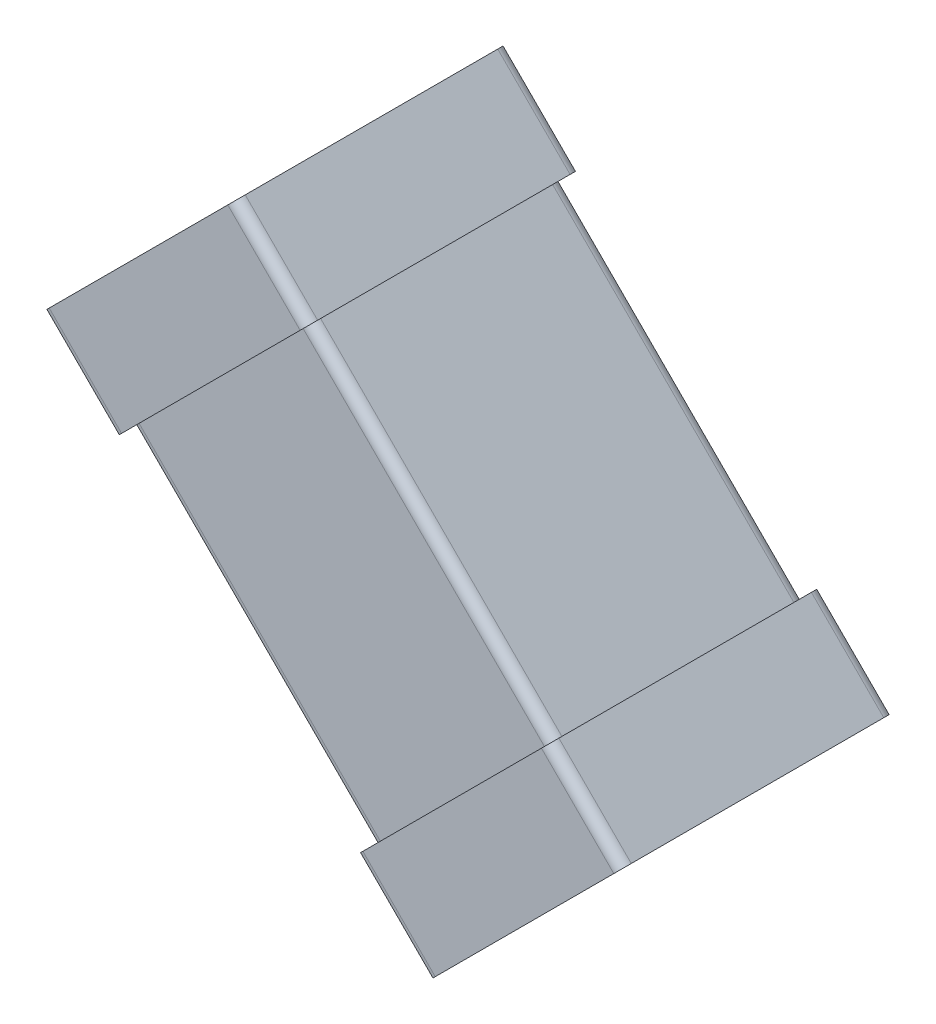
ISO-10303-21;
HEADER;
FILE_DESCRIPTION(('STEP AP214'),'2;1');
FILE_NAME('part.step','',(''),(''),'','','');
FILE_SCHEMA(('AUTOMOTIVE_DESIGN { 1 0 10303 214 1 1 1 1 }'));
ENDSEC;
DATA;
#1=APPLICATION_CONTEXT('core data for automotive mechanical design processes');
#2=APPLICATION_PROTOCOL_DEFINITION('international standard','automotive_design',2000,#1);
#3=PRODUCT_CONTEXT('',#1,'mechanical');
#4=PRODUCT('Part','Part','',(#3));
#5=PRODUCT_RELATED_PRODUCT_CATEGORY('part','',(#4));
#6=PRODUCT_DEFINITION_FORMATION('','',#4);
#7=PRODUCT_DEFINITION_CONTEXT('part definition',#1,'design');
#8=PRODUCT_DEFINITION('design','',#6,#7);
#9=PRODUCT_DEFINITION_SHAPE('','',#8);
#10=(LENGTH_UNIT() NAMED_UNIT(*) SI_UNIT(.MILLI.,.METRE.));
#11=(NAMED_UNIT(*) PLANE_ANGLE_UNIT() SI_UNIT($,.RADIAN.));
#12=(NAMED_UNIT(*) SI_UNIT($,.STERADIAN.) SOLID_ANGLE_UNIT());
#13=UNCERTAINTY_MEASURE_WITH_UNIT(LENGTH_MEASURE(1.E-05),#10,'distance_accuracy_value','');
#14=(GEOMETRIC_REPRESENTATION_CONTEXT(3) GLOBAL_UNCERTAINTY_ASSIGNED_CONTEXT((#13)) GLOBAL_UNIT_ASSIGNED_CONTEXT((#10,
#11,#12)) REPRESENTATION_CONTEXT('',''));
#15=CARTESIAN_POINT('',(0.,0.,0.));
#16=DIRECTION('',(0.,0.,1.));
#17=DIRECTION('',(1.,0.,0.));
#18=AXIS2_PLACEMENT_3D('',#15,#16,#17);
#19=CARTESIAN_POINT('',(156.286901567464,97.300571429774,112.211582908599));
#20=DIRECTION('',(-0.707106781186548,0.707106781186547,0.));
#21=DIRECTION('',(0.,0.,1.));
#22=AXIS2_PLACEMENT_3D('',#19,#20,#21);
#23=PLANE('',#22);
#24=DIRECTION('',(0.,0.,1.));
#25=VECTOR('',#24,1.);
#26=CARTESIAN_POINT('',(156.286901567464,97.300571429774,112.211582908599));
#27=LINE('',#26,#25);
#28=CARTESIAN_POINT('',(156.286901567464,97.300571429774,112.241582908599));
#29=VERTEX_POINT('',#28);
#30=CARTESIAN_POINT('',(156.286901567464,97.300571429774,112.981582908599));
#31=VERTEX_POINT('',#30);
#32=EDGE_CURVE('E67',#29,#31,#27,.T.);
#33=ORIENTED_EDGE('',*,*,#32,.F.);
#34=CARTESIAN_POINT('',(156.265688364028,97.2793582263384,112.241582908599));
#35=DIRECTION('',(-0.707106781186548,0.707106781186547,0.));
#36=DIRECTION('',(0.,0.,1.));
#37=AXIS2_PLACEMENT_3D('',#34,#35,#36);
#38=CIRCLE('',#37,0.0300000000000023);
#39=CARTESIAN_POINT('',(156.265688364028,97.2793582263384,112.211582908599));
#40=VERTEX_POINT('',#39);
#41=EDGE_CURVE('E11',#29,#40,#38,.T.);
#42=ORIENTED_EDGE('',*,*,#41,.T.);
#43=DIRECTION('',(-0.707106781186547,-0.707106781186548,0.));
#44=VECTOR('',#43,1.);
#45=CARTESIAN_POINT('',(156.286901567464,97.300571429774,112.211582908599));
#46=LINE('',#45,#44);
#47=CARTESIAN_POINT('',(155.74242934595,96.7560992082604,112.211582908599));
#48=VERTEX_POINT('',#47);
#49=EDGE_CURVE('E55',#40,#48,#46,.T.);
#50=ORIENTED_EDGE('',*,*,#49,.T.);
#51=CARTESIAN_POINT('',(155.74242934595,96.7560992082604,112.241582908599));
#52=DIRECTION('',(0.707106781186548,-0.707106781186547,0.));
#53=DIRECTION('',(0.,0.,1.));
#54=AXIS2_PLACEMENT_3D('',#51,#52,#53);
#55=CIRCLE('',#54,0.0300000000000023);
#56=CARTESIAN_POINT('',(155.721216142514,96.7348860048248,112.241582908599));
#57=VERTEX_POINT('',#56);
#58=EDGE_CURVE('E323',#57,#48,#55,.T.);
#59=ORIENTED_EDGE('',*,*,#58,.F.);
#60=DIRECTION('',(0.,0.,1.));
#61=VECTOR('',#60,1.);
#62=CARTESIAN_POINT('',(155.721216142514,96.7348860048248,112.211582908599));
#63=LINE('',#62,#61);
#64=CARTESIAN_POINT('',(155.721216142514,96.7348860048248,112.981582908599));
#65=VERTEX_POINT('',#64);
#66=EDGE_CURVE('E405',#57,#65,#63,.T.);
#67=ORIENTED_EDGE('',*,*,#66,.T.);
#68=CARTESIAN_POINT('',(155.74242934595,96.7560992082604,112.981582908599));
#69=DIRECTION('',(-0.707106781186548,0.707106781186547,0.));
#70=DIRECTION('',(0.,0.,1.));
#71=AXIS2_PLACEMENT_3D('',#68,#69,#70);
#72=CIRCLE('',#71,0.0300000000000023);
#73=CARTESIAN_POINT('',(155.74242934595,96.7560992082604,113.011582908599));
#74=VERTEX_POINT('',#73);
#75=EDGE_CURVE('E402',#65,#74,#72,.T.);
#76=ORIENTED_EDGE('',*,*,#75,.T.);
#77=DIRECTION('',(-0.707106781186547,-0.707106781186548,0.));
#78=VECTOR('',#77,1.);
#79=CARTESIAN_POINT('',(156.286901567464,97.300571429774,113.011582908599));
#80=LINE('',#79,#78);
#81=CARTESIAN_POINT('',(156.265688364028,97.2793582263384,113.011582908599));
#82=VERTEX_POINT('',#81);
#83=EDGE_CURVE('E287',#82,#74,#80,.T.);
#84=ORIENTED_EDGE('',*,*,#83,.F.);
#85=CARTESIAN_POINT('',(156.265688364028,97.2793582263384,112.981582908599));
#86=DIRECTION('',(0.707106781186548,-0.707106781186547,0.));
#87=DIRECTION('',(0.,0.,1.));
#88=AXIS2_PLACEMENT_3D('',#85,#86,#87);
#89=CIRCLE('',#88,0.0300000000000023);
#90=EDGE_CURVE('E379',#31,#82,#89,.T.);
#91=ORIENTED_EDGE('',*,*,#90,.F.);
#92=EDGE_LOOP('',(#33,#42,#50,#59,#67,#76,#84,#91));
#93=FACE_BOUND('',#92,.T.);
#94=ADVANCED_FACE('F44',(#93),#23,.T.);
#95=CARTESIAN_POINT('',(155.93334817687,96.5227539704688,112.211582908599));
#96=DIRECTION('',(-0.707106781186547,-0.707106781186548,0.));
#97=DIRECTION('',(-0.707106781186548,0.707106781186547,0.));
#98=AXIS2_PLACEMENT_3D('',#95,#96,#97);
#99=PLANE('',#98);
#100=ORIENTED_EDGE('',*,*,#66,.F.);
#101=DIRECTION('',(-0.707106781186548,0.707106781186547,0.));
#102=VECTOR('',#101,1.);
#103=CARTESIAN_POINT('',(155.93334817687,96.5227539704688,112.241582908599));
#104=LINE('',#103,#102);
#105=CARTESIAN_POINT('',(155.93334817687,96.5227539704688,112.241582908599));
#106=VERTEX_POINT('',#105);
#107=EDGE_CURVE('E292',#106,#57,#104,.T.);
#108=ORIENTED_EDGE('',*,*,#107,.F.);
#109=DIRECTION('',(0.,0.,1.));
#110=VECTOR('',#109,1.);
#111=CARTESIAN_POINT('',(155.93334817687,96.5227539704688,112.211582908599));
#112=LINE('',#111,#110);
#113=CARTESIAN_POINT('',(155.93334817687,96.5227539704688,112.981582908599));
#114=VERTEX_POINT('',#113);
#115=EDGE_CURVE('E406',#106,#114,#112,.T.);
#116=ORIENTED_EDGE('',*,*,#115,.T.);
#117=DIRECTION('',(-0.707106781186548,0.707106781186547,0.));
#118=VECTOR('',#117,1.);
#119=CARTESIAN_POINT('',(155.93334817687,96.5227539704688,112.981582908599));
#120=LINE('',#119,#118);
#121=EDGE_CURVE('E297',#114,#65,#120,.T.);
#122=ORIENTED_EDGE('',*,*,#121,.T.);
#123=EDGE_LOOP('',(#100,#108,#116,#122));
#124=FACE_BOUND('',#123,.T.);
#125=ADVANCED_FACE('F551',(#124),#99,.T.);
#126=CARTESIAN_POINT('',(155.954561380306,96.5439671739044,112.981582908599));
#127=DIRECTION('',(-0.707106781186548,0.707106781186548,0.));
#128=DIRECTION('',(-0.707106781186548,-0.707106781186548,0.));
#129=AXIS2_PLACEMENT_3D('',#126,#127,#128);
#130=CYLINDRICAL_SURFACE('',#129,0.0299999999999963);
#131=CARTESIAN_POINT('',(155.954561380306,96.5439671739044,112.981582908599));
#132=DIRECTION('',(-0.707106781186548,0.707106781186547,0.));
#133=DIRECTION('',(0.,0.,1.));
#134=AXIS2_PLACEMENT_3D('',#131,#132,#133);
#135=CIRCLE('',#134,0.0300000000000023);
#136=CARTESIAN_POINT('',(155.954561380306,96.5439671739044,113.011582908599));
#137=VERTEX_POINT('',#136);
#138=EDGE_CURVE('E291',#114,#137,#135,.T.);
#139=ORIENTED_EDGE('',*,*,#138,.T.);
#140=DIRECTION('',(-0.707106781186548,0.707106781186547,0.));
#141=VECTOR('',#140,1.);
#142=CARTESIAN_POINT('',(155.954561380306,96.5439671739044,113.011582908599));
#143=LINE('',#142,#141);
#144=EDGE_CURVE('E279',#137,#74,#143,.T.);
#145=ORIENTED_EDGE('',*,*,#144,.T.);
#146=ORIENTED_EDGE('',*,*,#75,.F.);
#147=ORIENTED_EDGE('',*,*,#121,.F.);
#148=EDGE_LOOP('',(#139,#145,#146,#147));
#149=FACE_BOUND('',#148,.T.);
#150=ADVANCED_FACE('F295',(#149),#130,.T.);
#151=CARTESIAN_POINT('',(155.954561380306,96.5439671739044,112.241582908599));
#152=DIRECTION('',(-0.707106781186548,0.707106781186548,0.));
#153=DIRECTION('',(-0.707106781186548,-0.707106781186548,0.));
#154=AXIS2_PLACEMENT_3D('',#151,#152,#153);
#155=CYLINDRICAL_SURFACE('',#154,0.0299999999999963);
#156=ORIENTED_EDGE('',*,*,#107,.T.);
#157=ORIENTED_EDGE('',*,*,#58,.T.);
#158=DIRECTION('',(-0.707106781186548,0.707106781186547,0.));
#159=VECTOR('',#158,1.);
#160=CARTESIAN_POINT('',(155.954561380306,96.5439671739044,112.211582908599));
#161=LINE('',#160,#159);
#162=CARTESIAN_POINT('',(155.954561380306,96.5439671739044,112.211582908599));
#163=VERTEX_POINT('',#162);
#164=EDGE_CURVE('E384',#163,#48,#161,.T.);
#165=ORIENTED_EDGE('',*,*,#164,.F.);
#166=CARTESIAN_POINT('',(155.954561380306,96.5439671739044,112.241582908599));
#167=DIRECTION('',(0.707106781186548,-0.707106781186547,0.));
#168=DIRECTION('',(0.,0.,1.));
#169=AXIS2_PLACEMENT_3D('',#166,#167,#168);
#170=CIRCLE('',#169,0.0300000000000023);
#171=EDGE_CURVE('E308',#106,#163,#170,.T.);
#172=ORIENTED_EDGE('',*,*,#171,.F.);
#173=EDGE_LOOP('',(#156,#157,#165,#172));
#174=FACE_BOUND('',#173,.T.);
#175=ADVANCED_FACE('F572',(#174),#155,.T.);
#176=CARTESIAN_POINT('',(156.499033601819,97.0884393954181,113.011582908599));
#177=DIRECTION('',(0.,0.,1.));
#178=DIRECTION('',(1.,0.,0.));
#179=AXIS2_PLACEMENT_3D('',#176,#177,#178);
#180=PLANE('',#179);
#181=DIRECTION('',(-0.707106781186547,-0.707106781186548,0.));
#182=VECTOR('',#181,1.);
#183=CARTESIAN_POINT('',(156.499033601819,97.0884393954181,113.011582908599));
#184=LINE('',#183,#182);
#185=CARTESIAN_POINT('',(156.477820398384,97.0672261919825,113.011582908599));
#186=VERTEX_POINT('',#185);
#187=EDGE_CURVE('E284',#186,#137,#184,.T.);
#188=ORIENTED_EDGE('',*,*,#187,.F.);
#189=DIRECTION('',(-0.707106781186548,0.707106781186547,0.));
#190=VECTOR('',#189,1.);
#191=CARTESIAN_POINT('',(156.477820398384,97.0672261919825,113.011582908599));
#192=LINE('',#191,#190);
#193=EDGE_CURVE('E444',#186,#82,#192,.T.);
#194=ORIENTED_EDGE('',*,*,#193,.T.);
#195=ORIENTED_EDGE('',*,*,#83,.T.);
#196=ORIENTED_EDGE('',*,*,#144,.F.);
#197=EDGE_LOOP('',(#188,#194,#195,#196));
#198=FACE_BOUND('',#197,.T.);
#199=ADVANCED_FACE('F281',(#198),#180,.T.);
#200=CARTESIAN_POINT('',(156.499033601819,97.0884393954181,112.211582908599));
#201=DIRECTION('',(0.,0.,1.));
#202=DIRECTION('',(1.,0.,0.));
#203=AXIS2_PLACEMENT_3D('',#200,#201,#202);
#204=PLANE('',#203);
#205=ORIENTED_EDGE('',*,*,#164,.T.);
#206=ORIENTED_EDGE('',*,*,#49,.F.);
#207=DIRECTION('',(-0.707106781186548,0.707106781186547,0.));
#208=VECTOR('',#207,1.);
#209=CARTESIAN_POINT('',(156.477820398384,97.0672261919825,112.211582908599));
#210=LINE('',#209,#208);
#211=CARTESIAN_POINT('',(156.477820398384,97.0672261919825,112.211582908599));
#212=VERTEX_POINT('',#211);
#213=EDGE_CURVE('E392',#212,#40,#210,.T.);
#214=ORIENTED_EDGE('',*,*,#213,.F.);
#215=DIRECTION('',(-0.707106781186547,-0.707106781186548,0.));
#216=VECTOR('',#215,1.);
#217=CARTESIAN_POINT('',(156.499033601819,97.0884393954181,112.211582908599));
#218=LINE('',#217,#216);
#219=EDGE_CURVE('E378',#212,#163,#218,.T.);
#220=ORIENTED_EDGE('',*,*,#219,.T.);
#221=EDGE_LOOP('',(#205,#206,#214,#220));
#222=FACE_BOUND('',#221,.T.);
#223=ADVANCED_FACE('F570',(#222),#204,.F.);
#224=CARTESIAN_POINT('',(156.477820398384,97.0672261919825,112.981582908599));
#225=DIRECTION('',(-0.707106781186548,0.707106781186548,0.));
#226=DIRECTION('',(0.707106781186548,0.707106781186548,0.));
#227=AXIS2_PLACEMENT_3D('',#224,#225,#226);
#228=CYLINDRICAL_SURFACE('',#227,0.0299999999999963);
#229=DIRECTION('',(-0.707106781186548,0.707106781186547,0.));
#230=VECTOR('',#229,1.);
#231=CARTESIAN_POINT('',(156.499033601819,97.0884393954181,112.981582908599));
#232=LINE('',#231,#230);
#233=CARTESIAN_POINT('',(156.499033601819,97.0884393954181,112.981582908599));
#234=VERTEX_POINT('',#233);
#235=EDGE_CURVE('E374',#234,#31,#232,.T.);
#236=ORIENTED_EDGE('',*,*,#235,.T.);
#237=ORIENTED_EDGE('',*,*,#90,.T.);
#238=ORIENTED_EDGE('',*,*,#193,.F.);
#239=CARTESIAN_POINT('',(156.477820398384,97.0672261919825,112.981582908599));
#240=DIRECTION('',(0.707106781186548,-0.707106781186547,0.));
#241=DIRECTION('',(0.,0.,1.));
#242=AXIS2_PLACEMENT_3D('',#239,#240,#241);
#243=CIRCLE('',#242,0.0300000000000023);
#244=EDGE_CURVE('E306',#234,#186,#243,.T.);
#245=ORIENTED_EDGE('',*,*,#244,.F.);
#246=EDGE_LOOP('',(#236,#237,#238,#245));
#247=FACE_BOUND('',#246,.T.);
#248=ADVANCED_FACE('F566',(#247),#228,.T.);
#249=CARTESIAN_POINT('',(156.477820398384,97.0672261919825,112.241582908599));
#250=DIRECTION('',(-0.707106781186548,0.707106781186548,0.));
#251=DIRECTION('',(0.707106781186548,0.707106781186548,0.));
#252=AXIS2_PLACEMENT_3D('',#249,#250,#251);
#253=CYLINDRICAL_SURFACE('',#252,0.0299999999999963);
#254=CARTESIAN_POINT('',(156.477820398384,97.0672261919825,112.241582908599));
#255=DIRECTION('',(-0.707106781186548,0.707106781186547,0.));
#256=DIRECTION('',(0.,0.,1.));
#257=AXIS2_PLACEMENT_3D('',#254,#255,#256);
#258=CIRCLE('',#257,0.0300000000000023);
#259=CARTESIAN_POINT('',(156.499033601819,97.0884393954181,112.241582908599));
#260=VERTEX_POINT('',#259);
#261=EDGE_CURVE('E388',#260,#212,#258,.T.);
#262=ORIENTED_EDGE('',*,*,#261,.T.);
#263=ORIENTED_EDGE('',*,*,#213,.T.);
#264=ORIENTED_EDGE('',*,*,#41,.F.);
#265=DIRECTION('',(-0.707106781186548,0.707106781186547,0.));
#266=VECTOR('',#265,1.);
#267=CARTESIAN_POINT('',(156.499033601819,97.0884393954181,112.241582908599));
#268=LINE('',#267,#266);
#269=EDGE_CURVE('E407',#260,#29,#268,.T.);
#270=ORIENTED_EDGE('',*,*,#269,.F.);
#271=EDGE_LOOP('',(#262,#263,#264,#270));
#272=FACE_BOUND('',#271,.T.);
#273=ADVANCED_FACE('F569',(#272),#253,.T.);
#274=CARTESIAN_POINT('',(156.499033601819,97.0884393954181,112.211582908599));
#275=DIRECTION('',(-0.707106781186547,-0.707106781186548,0.));
#276=DIRECTION('',(-0.707106781186548,0.707106781186547,0.));
#277=AXIS2_PLACEMENT_3D('',#274,#275,#276);
#278=PLANE('',#277);
#279=ORIENTED_EDGE('',*,*,#235,.F.);
#280=DIRECTION('',(0.,0.,1.));
#281=VECTOR('',#280,1.);
#282=CARTESIAN_POINT('',(156.499033601819,97.0884393954181,112.211582908599));
#283=LINE('',#282,#281);
#284=EDGE_CURVE('E316',#260,#234,#283,.T.);
#285=ORIENTED_EDGE('',*,*,#284,.F.);
#286=ORIENTED_EDGE('',*,*,#269,.T.);
#287=ORIENTED_EDGE('',*,*,#32,.T.);
#288=EDGE_LOOP('',(#279,#285,#286,#287));
#289=FACE_BOUND('',#288,.T.);
#290=ADVANCED_FACE('F716',(#289),#278,.F.);
#291=CARTESIAN_POINT('',(156.499033601819,97.0884393954181,112.211582908599));
#292=DIRECTION('',(-0.707106781186548,0.707106781186547,0.));
#293=DIRECTION('',(0.,0.,1.));
#294=AXIS2_PLACEMENT_3D('',#291,#292,#293);
#295=PLANE('',#294);
#296=ORIENTED_EDGE('',*,*,#244,.T.);
#297=ORIENTED_EDGE('',*,*,#187,.T.);
#298=ORIENTED_EDGE('',*,*,#138,.F.);
#299=ORIENTED_EDGE('',*,*,#115,.F.);
#300=ORIENTED_EDGE('',*,*,#171,.T.);
#301=ORIENTED_EDGE('',*,*,#219,.F.);
#302=ORIENTED_EDGE('',*,*,#261,.F.);
#303=ORIENTED_EDGE('',*,*,#284,.T.);
#304=EDGE_LOOP('',(#296,#297,#298,#299,#300,#301,#302,#303));
#305=FACE_BOUND('',#304,.T.);
#306=DIRECTION('',(-0.707106781186547,-0.707106781186548,0.));
#307=VECTOR('',#306,1.);
#308=CARTESIAN_POINT('',(156.477820398384,97.0672261919825,112.241582908599));
#309=LINE('',#308,#307);
#310=CARTESIAN_POINT('',(156.456607194948,97.0460129885469,112.241582908599));
#311=VERTEX_POINT('',#310);
#312=CARTESIAN_POINT('',(155.975774583741,96.56518037734,112.241582908599));
#313=VERTEX_POINT('',#312);
#314=EDGE_CURVE('E430',#311,#313,#309,.T.);
#315=ORIENTED_EDGE('',*,*,#314,.T.);
#316=CARTESIAN_POINT('',(155.975774583741,96.56518037734,112.271582908599));
#317=DIRECTION('',(0.707106781186548,-0.707106781186547,0.));
#318=DIRECTION('',(0.,0.,1.));
#319=AXIS2_PLACEMENT_3D('',#316,#317,#318);
#320=CIRCLE('',#319,0.0300000000000023);
#321=CARTESIAN_POINT('',(155.954561380306,96.5439671739044,112.271582908599));
#322=VERTEX_POINT('',#321);
#323=EDGE_CURVE('E393',#322,#313,#320,.T.);
#324=ORIENTED_EDGE('',*,*,#323,.F.);
#325=DIRECTION('',(0.,0.,1.));
#326=VECTOR('',#325,1.);
#327=CARTESIAN_POINT('',(155.954561380306,96.5439671739044,112.241582908599));
#328=LINE('',#327,#326);
#329=CARTESIAN_POINT('',(155.954561380306,96.5439671739044,112.951582908599));
#330=VERTEX_POINT('',#329);
#331=EDGE_CURVE('E482',#322,#330,#328,.T.);
#332=ORIENTED_EDGE('',*,*,#331,.T.);
#333=CARTESIAN_POINT('',(155.975774583741,96.56518037734,112.951582908599));
#334=DIRECTION('',(-0.707106781186548,0.707106781186547,0.));
#335=DIRECTION('',(0.,0.,1.));
#336=AXIS2_PLACEMENT_3D('',#333,#334,#335);
#337=CIRCLE('',#336,0.0300000000000023);
#338=CARTESIAN_POINT('',(155.975774583741,96.56518037734,112.981582908599));
#339=VERTEX_POINT('',#338);
#340=EDGE_CURVE('E530',#330,#339,#337,.T.);
#341=ORIENTED_EDGE('',*,*,#340,.T.);
#342=DIRECTION('',(-0.707106781186547,-0.707106781186548,0.));
#343=VECTOR('',#342,1.);
#344=CARTESIAN_POINT('',(156.477820398384,97.0672261919825,112.981582908599));
#345=LINE('',#344,#343);
#346=CARTESIAN_POINT('',(156.456607194948,97.0460129885469,112.981582908599));
#347=VERTEX_POINT('',#346);
#348=EDGE_CURVE('E166',#347,#339,#345,.T.);
#349=ORIENTED_EDGE('',*,*,#348,.F.);
#350=CARTESIAN_POINT('',(156.456607194948,97.0460129885469,112.951582908599));
#351=DIRECTION('',(0.707106781186548,-0.707106781186547,0.));
#352=DIRECTION('',(0.,0.,1.));
#353=AXIS2_PLACEMENT_3D('',#350,#351,#352);
#354=CIRCLE('',#353,0.0300000000000023);
#355=CARTESIAN_POINT('',(156.477820398384,97.0672261919825,112.951582908599));
#356=VERTEX_POINT('',#355);
#357=EDGE_CURVE('E487',#356,#347,#354,.T.);
#358=ORIENTED_EDGE('',*,*,#357,.F.);
#359=DIRECTION('',(0.,0.,1.));
#360=VECTOR('',#359,1.);
#361=CARTESIAN_POINT('',(156.477820398384,97.0672261919825,112.241582908599));
#362=LINE('',#361,#360);
#363=CARTESIAN_POINT('',(156.477820398384,97.0672261919825,112.271582908599));
#364=VERTEX_POINT('',#363);
#365=EDGE_CURVE('E452',#364,#356,#362,.T.);
#366=ORIENTED_EDGE('',*,*,#365,.F.);
#367=CARTESIAN_POINT('',(156.456607194948,97.0460129885469,112.271582908599));
#368=DIRECTION('',(-0.707106781186548,0.707106781186547,0.));
#369=DIRECTION('',(0.,0.,1.));
#370=AXIS2_PLACEMENT_3D('',#367,#368,#369);
#371=CIRCLE('',#370,0.0300000000000023);
#372=EDGE_CURVE('E48',#364,#311,#371,.T.);
#373=ORIENTED_EDGE('',*,*,#372,.T.);
#374=EDGE_LOOP('',(#315,#324,#332,#341,#349,#358,#366,#373));
#375=FACE_BOUND('',#374,.T.);
#376=ADVANCED_FACE('F304',(#305,#375),#295,.F.);
#377=CARTESIAN_POINT('',(157.184927179571,96.3601194107959,112.241582908599));
#378=DIRECTION('',(-0.707106781186547,-0.707106781186548,0.));
#379=DIRECTION('',(-0.707106781186548,0.707106781186547,0.));
#380=AXIS2_PLACEMENT_3D('',#377,#378,#379);
#381=PLANE('',#380);
#382=DIRECTION('',(-0.707106781186548,0.707106781186547,0.));
#383=VECTOR('',#382,1.);
#384=CARTESIAN_POINT('',(157.184927179571,96.3601194107959,112.951582908599));
#385=LINE('',#384,#383);
#386=CARTESIAN_POINT('',(157.184927179571,96.3601194107959,112.951582908599));
#387=VERTEX_POINT('',#386);
#388=EDGE_CURVE('E483',#387,#356,#385,.T.);
#389=ORIENTED_EDGE('',*,*,#388,.F.);
#390=DIRECTION('',(0.,0.,1.));
#391=VECTOR('',#390,1.);
#392=CARTESIAN_POINT('',(157.184927179571,96.3601194107959,112.241582908599));
#393=LINE('',#392,#391);
#394=CARTESIAN_POINT('',(157.184927179571,96.3601194107959,112.271582908599));
#395=VERTEX_POINT('',#394);
#396=EDGE_CURVE('E259',#395,#387,#393,.T.);
#397=ORIENTED_EDGE('',*,*,#396,.F.);
#398=DIRECTION('',(-0.707106781186548,0.707106781186547,0.));
#399=VECTOR('',#398,1.);
#400=CARTESIAN_POINT('',(157.184927179571,96.3601194107959,112.271582908599));
#401=LINE('',#400,#399);
#402=EDGE_CURVE('E450',#395,#364,#401,.T.);
#403=ORIENTED_EDGE('',*,*,#402,.T.);
#404=ORIENTED_EDGE('',*,*,#365,.T.);
#405=EDGE_LOOP('',(#389,#397,#403,#404));
#406=FACE_BOUND('',#405,.T.);
#407=ADVANCED_FACE('F545',(#406),#381,.F.);
#408=CARTESIAN_POINT('',(157.163713976134,96.3389062073603,112.951582908599));
#409=DIRECTION('',(-0.707106781186548,0.707106781186548,0.));
#410=DIRECTION('',(0.707106781186548,0.707106781186548,0.));
#411=AXIS2_PLACEMENT_3D('',#408,#409,#410);
#412=CYLINDRICAL_SURFACE('',#411,0.0299999999999963);
#413=ORIENTED_EDGE('',*,*,#388,.T.);
#414=ORIENTED_EDGE('',*,*,#357,.T.);
#415=DIRECTION('',(-0.707106781186548,0.707106781186547,0.));
#416=VECTOR('',#415,1.);
#417=CARTESIAN_POINT('',(157.163713976134,96.3389062073603,112.981582908599));
#418=LINE('',#417,#416);
#419=CARTESIAN_POINT('',(157.163713976134,96.3389062073603,112.981582908599));
#420=VERTEX_POINT('',#419);
#421=EDGE_CURVE('E441',#420,#347,#418,.T.);
#422=ORIENTED_EDGE('',*,*,#421,.F.);
#423=CARTESIAN_POINT('',(157.163713976134,96.3389062073603,112.951582908599));
#424=DIRECTION('',(0.707106781186548,-0.707106781186547,0.));
#425=DIRECTION('',(0.,0.,1.));
#426=AXIS2_PLACEMENT_3D('',#423,#424,#425);
#427=CIRCLE('',#426,0.0300000000000023);
#428=EDGE_CURVE('E475',#387,#420,#427,.T.);
#429=ORIENTED_EDGE('',*,*,#428,.F.);
#430=EDGE_LOOP('',(#413,#414,#422,#429));
#431=FACE_BOUND('',#430,.T.);
#432=ADVANCED_FACE('F538',(#431),#412,.T.);
#433=CARTESIAN_POINT('',(157.184927179571,96.3601194107959,112.981582908599));
#434=DIRECTION('',(0.,0.,1.));
#435=DIRECTION('',(1.,0.,0.));
#436=AXIS2_PLACEMENT_3D('',#433,#434,#435);
#437=PLANE('',#436);
#438=DIRECTION('',(-0.707106781186547,-0.707106781186548,0.));
#439=VECTOR('',#438,1.);
#440=CARTESIAN_POINT('',(157.184927179571,96.3601194107959,112.981582908599));
#441=LINE('',#440,#439);
#442=CARTESIAN_POINT('',(156.682881364928,95.8580735961535,112.981582908599));
#443=VERTEX_POINT('',#442);
#444=EDGE_CURVE('E401',#420,#443,#441,.T.);
#445=ORIENTED_EDGE('',*,*,#444,.F.);
#446=ORIENTED_EDGE('',*,*,#421,.T.);
#447=ORIENTED_EDGE('',*,*,#348,.T.);
#448=DIRECTION('',(-0.707106781186548,0.707106781186547,0.));
#449=VECTOR('',#448,1.);
#450=CARTESIAN_POINT('',(156.682881364928,95.8580735961535,112.981582908599));
#451=LINE('',#450,#449);
#452=EDGE_CURVE('E368',#443,#339,#451,.T.);
#453=ORIENTED_EDGE('',*,*,#452,.F.);
#454=EDGE_LOOP('',(#445,#446,#447,#453));
#455=FACE_BOUND('',#454,.T.);
#456=ADVANCED_FACE('F536',(#455),#437,.T.);
#457=CARTESIAN_POINT('',(156.682881364928,95.8580735961535,112.951582908599));
#458=DIRECTION('',(-0.707106781186548,0.707106781186548,0.));
#459=DIRECTION('',(-0.707106781186548,-0.707106781186548,0.));
#460=AXIS2_PLACEMENT_3D('',#457,#458,#459);
#461=CYLINDRICAL_SURFACE('',#460,0.0299999999999963);
#462=CARTESIAN_POINT('',(156.682881364928,95.8580735961535,112.951582908599));
#463=DIRECTION('',(-0.707106781186548,0.707106781186547,0.));
#464=DIRECTION('',(0.,0.,1.));
#465=AXIS2_PLACEMENT_3D('',#462,#463,#464);
#466=CIRCLE('',#465,0.0300000000000023);
#467=CARTESIAN_POINT('',(156.661668161493,95.8368603927179,112.951582908599));
#468=VERTEX_POINT('',#467);
#469=EDGE_CURVE('E372',#468,#443,#466,.T.);
#470=ORIENTED_EDGE('',*,*,#469,.T.);
#471=ORIENTED_EDGE('',*,*,#452,.T.);
#472=ORIENTED_EDGE('',*,*,#340,.F.);
#473=DIRECTION('',(-0.707106781186548,0.707106781186547,0.));
#474=VECTOR('',#473,1.);
#475=CARTESIAN_POINT('',(156.661668161493,95.8368603927179,112.951582908599));
#476=LINE('',#475,#474);
#477=EDGE_CURVE('E320',#468,#330,#476,.T.);
#478=ORIENTED_EDGE('',*,*,#477,.F.);
#479=EDGE_LOOP('',(#470,#471,#472,#478));
#480=FACE_BOUND('',#479,.T.);
#481=ADVANCED_FACE('F529',(#480),#461,.T.);
#482=CARTESIAN_POINT('',(156.661668161493,95.8368603927179,112.241582908599));
#483=DIRECTION('',(-0.707106781186547,-0.707106781186548,0.));
#484=DIRECTION('',(-0.707106781186548,0.707106781186547,0.));
#485=AXIS2_PLACEMENT_3D('',#482,#483,#484);
#486=PLANE('',#485);
#487=ORIENTED_EDGE('',*,*,#331,.F.);
#488=DIRECTION('',(-0.707106781186548,0.707106781186547,0.));
#489=VECTOR('',#488,1.);
#490=CARTESIAN_POINT('',(156.661668161493,95.8368603927179,112.271582908599));
#491=LINE('',#490,#489);
#492=CARTESIAN_POINT('',(156.661668161493,95.8368603927179,112.271582908599));
#493=VERTEX_POINT('',#492);
#494=EDGE_CURVE('E396',#493,#322,#491,.T.);
#495=ORIENTED_EDGE('',*,*,#494,.F.);
#496=DIRECTION('',(0.,0.,1.));
#497=VECTOR('',#496,1.);
#498=CARTESIAN_POINT('',(156.661668161493,95.8368603927179,112.241582908599));
#499=LINE('',#498,#497);
#500=EDGE_CURVE('E373',#493,#468,#499,.T.);
#501=ORIENTED_EDGE('',*,*,#500,.T.);
#502=ORIENTED_EDGE('',*,*,#477,.T.);
#503=EDGE_LOOP('',(#487,#495,#501,#502));
#504=FACE_BOUND('',#503,.T.);
#505=ADVANCED_FACE('F525',(#504),#486,.T.);
#506=CARTESIAN_POINT('',(156.682881364928,95.8580735961535,112.271582908599));
#507=DIRECTION('',(-0.707106781186548,0.707106781186548,0.));
#508=DIRECTION('',(-0.707106781186548,-0.707106781186548,0.));
#509=AXIS2_PLACEMENT_3D('',#506,#507,#508);
#510=CYLINDRICAL_SURFACE('',#509,0.0299999999999963);
#511=ORIENTED_EDGE('',*,*,#494,.T.);
#512=ORIENTED_EDGE('',*,*,#323,.T.);
#513=DIRECTION('',(-0.707106781186548,0.707106781186547,0.));
#514=VECTOR('',#513,1.);
#515=CARTESIAN_POINT('',(156.682881364928,95.8580735961535,112.241582908599));
#516=LINE('',#515,#514);
#517=CARTESIAN_POINT('',(156.682881364928,95.8580735961535,112.241582908599));
#518=VERTEX_POINT('',#517);
#519=EDGE_CURVE('E397',#518,#313,#516,.T.);
#520=ORIENTED_EDGE('',*,*,#519,.F.);
#521=CARTESIAN_POINT('',(156.682881364928,95.8580735961535,112.271582908599));
#522=DIRECTION('',(0.707106781186548,-0.707106781186547,0.));
#523=DIRECTION('',(0.,0.,1.));
#524=AXIS2_PLACEMENT_3D('',#521,#522,#523);
#525=CIRCLE('',#524,0.0300000000000023);
#526=EDGE_CURVE('E398',#493,#518,#525,.T.);
#527=ORIENTED_EDGE('',*,*,#526,.F.);
#528=EDGE_LOOP('',(#511,#512,#520,#527));
#529=FACE_BOUND('',#528,.T.);
#530=ADVANCED_FACE('F588',(#529),#510,.T.);
#531=CARTESIAN_POINT('',(157.184927179571,96.3601194107959,112.241582908599));
#532=DIRECTION('',(0.,0.,1.));
#533=DIRECTION('',(1.,0.,0.));
#534=AXIS2_PLACEMENT_3D('',#531,#532,#533);
#535=PLANE('',#534);
#536=ORIENTED_EDGE('',*,*,#519,.T.);
#537=ORIENTED_EDGE('',*,*,#314,.F.);
#538=DIRECTION('',(-0.707106781186548,0.707106781186547,0.));
#539=VECTOR('',#538,1.);
#540=CARTESIAN_POINT('',(157.163713976134,96.3389062073603,112.241582908599));
#541=LINE('',#540,#539);
#542=CARTESIAN_POINT('',(157.163713976134,96.3389062073603,112.241582908599));
#543=VERTEX_POINT('',#542);
#544=EDGE_CURVE('E357',#543,#311,#541,.T.);
#545=ORIENTED_EDGE('',*,*,#544,.F.);
#546=DIRECTION('',(-0.707106781186547,-0.707106781186548,0.));
#547=VECTOR('',#546,1.);
#548=CARTESIAN_POINT('',(157.184927179571,96.3601194107959,112.241582908599));
#549=LINE('',#548,#547);
#550=EDGE_CURVE('E356',#543,#518,#549,.T.);
#551=ORIENTED_EDGE('',*,*,#550,.T.);
#552=EDGE_LOOP('',(#536,#537,#545,#551));
#553=FACE_BOUND('',#552,.T.);
#554=ADVANCED_FACE('F46',(#553),#535,.F.);
#555=CARTESIAN_POINT('',(157.163713976134,96.3389062073603,112.271582908599));
#556=DIRECTION('',(-0.707106781186548,0.707106781186548,0.));
#557=DIRECTION('',(0.707106781186548,0.707106781186548,0.));
#558=AXIS2_PLACEMENT_3D('',#555,#556,#557);
#559=CYLINDRICAL_SURFACE('',#558,0.0299999999999963);
#560=CARTESIAN_POINT('',(157.163713976134,96.3389062073603,112.271582908599));
#561=DIRECTION('',(-0.707106781186548,0.707106781186547,0.));
#562=DIRECTION('',(0.,0.,1.));
#563=AXIS2_PLACEMENT_3D('',#560,#561,#562);
#564=CIRCLE('',#563,0.0300000000000023);
#565=EDGE_CURVE('E352',#395,#543,#564,.T.);
#566=ORIENTED_EDGE('',*,*,#565,.T.);
#567=ORIENTED_EDGE('',*,*,#544,.T.);
#568=ORIENTED_EDGE('',*,*,#372,.F.);
#569=ORIENTED_EDGE('',*,*,#402,.F.);
#570=EDGE_LOOP('',(#566,#567,#568,#569));
#571=FACE_BOUND('',#570,.T.);
#572=ADVANCED_FACE('F585',(#571),#559,.T.);
#573=CARTESIAN_POINT('',(157.206140383006,96.3813326142315,112.211582908599));
#574=DIRECTION('',(-0.707106781186548,0.707106781186547,0.));
#575=DIRECTION('',(0.,0.,1.));
#576=AXIS2_PLACEMENT_3D('',#573,#574,#575);
#577=PLANE('',#576);
#578=DIRECTION('',(0.,0.,1.));
#579=VECTOR('',#578,1.);
#580=CARTESIAN_POINT('',(157.206140383006,96.3813326142315,112.211582908599));
#581=LINE('',#580,#579);
#582=CARTESIAN_POINT('',(157.206140383006,96.3813326142315,112.241582908599));
#583=VERTEX_POINT('',#582);
#584=CARTESIAN_POINT('',(157.206140383006,96.3813326142315,112.981582908599));
#585=VERTEX_POINT('',#584);
#586=EDGE_CURVE('E431',#583,#585,#581,.T.);
#587=ORIENTED_EDGE('',*,*,#586,.F.);
#588=CARTESIAN_POINT('',(157.184927179571,96.3601194107959,112.241582908599));
#589=DIRECTION('',(-0.707106781186548,0.707106781186547,0.));
#590=DIRECTION('',(0.,0.,1.));
#591=AXIS2_PLACEMENT_3D('',#588,#589,#590);
#592=CIRCLE('',#591,0.0300000000000023);
#593=CARTESIAN_POINT('',(157.184927179571,96.3601194107959,112.211582908599));
#594=VERTEX_POINT('',#593);
#595=EDGE_CURVE('E382',#583,#594,#592,.T.);
#596=ORIENTED_EDGE('',*,*,#595,.T.);
#597=DIRECTION('',(-0.707106781186547,-0.707106781186548,0.));
#598=VECTOR('',#597,1.);
#599=CARTESIAN_POINT('',(157.206140383006,96.3813326142315,112.211582908599));
#600=LINE('',#599,#598);
#601=CARTESIAN_POINT('',(156.661668161493,95.8368603927179,112.211582908599));
#602=VERTEX_POINT('',#601);
#603=EDGE_CURVE('E494',#594,#602,#600,.T.);
#604=ORIENTED_EDGE('',*,*,#603,.T.);
#605=CARTESIAN_POINT('',(156.661668161493,95.8368603927179,112.241582908599));
#606=DIRECTION('',(0.707106781186548,-0.707106781186547,0.));
#607=DIRECTION('',(0.,0.,1.));
#608=AXIS2_PLACEMENT_3D('',#605,#606,#607);
#609=CIRCLE('',#608,0.0300000000000023);
#610=CARTESIAN_POINT('',(156.640454958056,95.8156471892823,112.241582908599));
#611=VERTEX_POINT('',#610);
#612=EDGE_CURVE('E224',#611,#602,#609,.T.);
#613=ORIENTED_EDGE('',*,*,#612,.F.);
#614=DIRECTION('',(0.,0.,1.));
#615=VECTOR('',#614,1.);
#616=CARTESIAN_POINT('',(156.640454958056,95.8156471892823,112.211582908599));
#617=LINE('',#616,#615);
#618=CARTESIAN_POINT('',(156.640454958056,95.8156471892823,112.981582908599));
#619=VERTEX_POINT('',#618);
#620=EDGE_CURVE('E512',#611,#619,#617,.T.);
#621=ORIENTED_EDGE('',*,*,#620,.T.);
#622=CARTESIAN_POINT('',(156.661668161493,95.8368603927179,112.981582908599));
#623=DIRECTION('',(-0.707106781186548,0.707106781186547,0.));
#624=DIRECTION('',(0.,0.,1.));
#625=AXIS2_PLACEMENT_3D('',#622,#623,#624);
#626=CIRCLE('',#625,0.0300000000000023);
#627=CARTESIAN_POINT('',(156.661668161493,95.8368603927179,113.011582908599));
#628=VERTEX_POINT('',#627);
#629=EDGE_CURVE('E235',#619,#628,#626,.T.);
#630=ORIENTED_EDGE('',*,*,#629,.T.);
#631=DIRECTION('',(-0.707106781186547,-0.707106781186548,0.));
#632=VECTOR('',#631,1.);
#633=CARTESIAN_POINT('',(157.206140383006,96.3813326142315,113.011582908599));
#634=LINE('',#633,#632);
#635=CARTESIAN_POINT('',(157.184927179571,96.3601194107959,113.011582908599));
#636=VERTEX_POINT('',#635);
#637=EDGE_CURVE('E327',#636,#628,#634,.T.);
#638=ORIENTED_EDGE('',*,*,#637,.F.);
#639=CARTESIAN_POINT('',(157.184927179571,96.3601194107959,112.981582908599));
#640=DIRECTION('',(0.707106781186548,-0.707106781186547,0.));
#641=DIRECTION('',(0.,0.,1.));
#642=AXIS2_PLACEMENT_3D('',#639,#640,#641);
#643=CIRCLE('',#642,0.0300000000000023);
#644=EDGE_CURVE('E411',#585,#636,#643,.T.);
#645=ORIENTED_EDGE('',*,*,#644,.F.);
#646=EDGE_LOOP('',(#587,#596,#604,#613,#621,#630,#638,#645));
#647=FACE_BOUND('',#646,.T.);
#648=ORIENTED_EDGE('',*,*,#565,.F.);
#649=ORIENTED_EDGE('',*,*,#396,.T.);
#650=ORIENTED_EDGE('',*,*,#428,.T.);
#651=ORIENTED_EDGE('',*,*,#444,.T.);
#652=ORIENTED_EDGE('',*,*,#469,.F.);
#653=ORIENTED_EDGE('',*,*,#500,.F.);
#654=ORIENTED_EDGE('',*,*,#526,.T.);
#655=ORIENTED_EDGE('',*,*,#550,.F.);
#656=EDGE_LOOP('',(#648,#649,#650,#651,#652,#653,#654,#655));
#657=FACE_BOUND('',#656,.T.);
#658=ADVANCED_FACE('F531',(#647,#657),#577,.T.);
#659=CARTESIAN_POINT('',(156.852586992413,95.6035151549263,112.211582908599));
#660=DIRECTION('',(-0.707106781186547,-0.707106781186548,0.));
#661=DIRECTION('',(-0.707106781186548,0.707106781186547,0.));
#662=AXIS2_PLACEMENT_3D('',#659,#660,#661);
#663=PLANE('',#662);
#664=ORIENTED_EDGE('',*,*,#620,.F.);
#665=DIRECTION('',(-0.707106781186548,0.707106781186547,0.));
#666=VECTOR('',#665,1.);
#667=CARTESIAN_POINT('',(156.852586992413,95.6035151549263,112.241582908599));
#668=LINE('',#667,#666);
#669=CARTESIAN_POINT('',(156.852586992413,95.6035151549263,112.241582908599));
#670=VERTEX_POINT('',#669);
#671=EDGE_CURVE('E333',#670,#611,#668,.T.);
#672=ORIENTED_EDGE('',*,*,#671,.F.);
#673=DIRECTION('',(0.,0.,1.));
#674=VECTOR('',#673,1.);
#675=CARTESIAN_POINT('',(156.852586992413,95.6035151549263,112.211582908599));
#676=LINE('',#675,#674);
#677=CARTESIAN_POINT('',(156.852586992413,95.6035151549263,112.981582908599));
#678=VERTEX_POINT('',#677);
#679=EDGE_CURVE('E361',#670,#678,#676,.T.);
#680=ORIENTED_EDGE('',*,*,#679,.T.);
#681=DIRECTION('',(-0.707106781186548,0.707106781186547,0.));
#682=VECTOR('',#681,1.);
#683=CARTESIAN_POINT('',(156.852586992413,95.6035151549263,112.981582908599));
#684=LINE('',#683,#682);
#685=EDGE_CURVE('E358',#678,#619,#684,.T.);
#686=ORIENTED_EDGE('',*,*,#685,.T.);
#687=EDGE_LOOP('',(#664,#672,#680,#686));
#688=FACE_BOUND('',#687,.T.);
#689=ADVANCED_FACE('F584',(#688),#663,.T.);
#690=CARTESIAN_POINT('',(156.873800195848,95.6247283583619,112.981582908599));
#691=DIRECTION('',(-0.707106781186548,0.707106781186548,0.));
#692=DIRECTION('',(-0.707106781186548,-0.707106781186548,0.));
#693=AXIS2_PLACEMENT_3D('',#690,#691,#692);
#694=CYLINDRICAL_SURFACE('',#693,0.0299999999999963);
#695=CARTESIAN_POINT('',(156.873800195848,95.6247283583619,112.981582908599));
#696=DIRECTION('',(-0.707106781186548,0.707106781186547,0.));
#697=DIRECTION('',(0.,0.,1.));
#698=AXIS2_PLACEMENT_3D('',#695,#696,#697);
#699=CIRCLE('',#698,0.0300000000000023);
#700=CARTESIAN_POINT('',(156.873800195848,95.6247283583619,113.011582908599));
#701=VERTEX_POINT('',#700);
#702=EDGE_CURVE('E362',#678,#701,#699,.T.);
#703=ORIENTED_EDGE('',*,*,#702,.T.);
#704=DIRECTION('',(-0.707106781186548,0.707106781186547,0.));
#705=VECTOR('',#704,1.);
#706=CARTESIAN_POINT('',(156.873800195848,95.6247283583619,113.011582908599));
#707=LINE('',#706,#705);
#708=EDGE_CURVE('E367',#701,#628,#707,.T.);
#709=ORIENTED_EDGE('',*,*,#708,.T.);
#710=ORIENTED_EDGE('',*,*,#629,.F.);
#711=ORIENTED_EDGE('',*,*,#685,.F.);
#712=EDGE_LOOP('',(#703,#709,#710,#711));
#713=FACE_BOUND('',#712,.T.);
#714=ADVANCED_FACE('F628',(#713),#694,.T.);
#715=CARTESIAN_POINT('',(156.873800195848,95.6247283583619,112.241582908599));
#716=DIRECTION('',(-0.707106781186548,0.707106781186548,0.));
#717=DIRECTION('',(-0.707106781186548,-0.707106781186548,0.));
#718=AXIS2_PLACEMENT_3D('',#715,#716,#717);
#719=CYLINDRICAL_SURFACE('',#718,0.0299999999999963);
#720=ORIENTED_EDGE('',*,*,#671,.T.);
#721=ORIENTED_EDGE('',*,*,#612,.T.);
#722=DIRECTION('',(-0.707106781186548,0.707106781186547,0.));
#723=VECTOR('',#722,1.);
#724=CARTESIAN_POINT('',(156.873800195848,95.6247283583619,112.211582908599));
#725=LINE('',#724,#723);
#726=CARTESIAN_POINT('',(156.873800195848,95.6247283583619,112.211582908599));
#727=VERTEX_POINT('',#726);
#728=EDGE_CURVE('E336',#727,#602,#725,.T.);
#729=ORIENTED_EDGE('',*,*,#728,.F.);
#730=CARTESIAN_POINT('',(156.873800195848,95.6247283583619,112.241582908599));
#731=DIRECTION('',(0.707106781186548,-0.707106781186547,0.));
#732=DIRECTION('',(0.,0.,1.));
#733=AXIS2_PLACEMENT_3D('',#730,#731,#732);
#734=CIRCLE('',#733,0.0300000000000023);
#735=EDGE_CURVE('E458',#670,#727,#734,.T.);
#736=ORIENTED_EDGE('',*,*,#735,.F.);
#737=EDGE_LOOP('',(#720,#721,#729,#736));
#738=FACE_BOUND('',#737,.T.);
#739=ADVANCED_FACE('F565',(#738),#719,.T.);
#740=CARTESIAN_POINT('',(157.418272417362,96.1692005798756,113.011582908599));
#741=DIRECTION('',(0.,0.,1.));
#742=DIRECTION('',(1.,0.,0.));
#743=AXIS2_PLACEMENT_3D('',#740,#741,#742);
#744=PLANE('',#743);
#745=DIRECTION('',(-0.707106781186547,-0.707106781186548,0.));
#746=VECTOR('',#745,1.);
#747=CARTESIAN_POINT('',(157.418272417362,96.1692005798756,113.011582908599));
#748=LINE('',#747,#746);
#749=CARTESIAN_POINT('',(157.397059213926,96.14798737644,113.011582908599));
#750=VERTEX_POINT('',#749);
#751=EDGE_CURVE('E454',#750,#701,#748,.T.);
#752=ORIENTED_EDGE('',*,*,#751,.F.);
#753=DIRECTION('',(-0.707106781186548,0.707106781186547,0.));
#754=VECTOR('',#753,1.);
#755=CARTESIAN_POINT('',(157.397059213926,96.14798737644,113.011582908599));
#756=LINE('',#755,#754);
#757=EDGE_CURVE('E324',#750,#636,#756,.T.);
#758=ORIENTED_EDGE('',*,*,#757,.T.);
#759=ORIENTED_EDGE('',*,*,#637,.T.);
#760=ORIENTED_EDGE('',*,*,#708,.F.);
#761=EDGE_LOOP('',(#752,#758,#759,#760));
#762=FACE_BOUND('',#761,.T.);
#763=ADVANCED_FACE('F562',(#762),#744,.T.);
#764=CARTESIAN_POINT('',(157.418272417362,96.1692005798756,112.211582908599));
#765=DIRECTION('',(0.,0.,1.));
#766=DIRECTION('',(1.,0.,0.));
#767=AXIS2_PLACEMENT_3D('',#764,#765,#766);
#768=PLANE('',#767);
#769=ORIENTED_EDGE('',*,*,#728,.T.);
#770=ORIENTED_EDGE('',*,*,#603,.F.);
#771=DIRECTION('',(-0.707106781186548,0.707106781186547,0.));
#772=VECTOR('',#771,1.);
#773=CARTESIAN_POINT('',(157.397059213926,96.14798737644,112.211582908599));
#774=LINE('',#773,#772);
#775=CARTESIAN_POINT('',(157.397059213926,96.14798737644,112.211582908599));
#776=VERTEX_POINT('',#775);
#777=EDGE_CURVE('E461',#776,#594,#774,.T.);
#778=ORIENTED_EDGE('',*,*,#777,.F.);
#779=DIRECTION('',(-0.707106781186547,-0.707106781186548,0.));
#780=VECTOR('',#779,1.);
#781=CARTESIAN_POINT('',(157.418272417362,96.1692005798756,112.211582908599));
#782=LINE('',#781,#780);
#783=EDGE_CURVE('E344',#776,#727,#782,.T.);
#784=ORIENTED_EDGE('',*,*,#783,.T.);
#785=EDGE_LOOP('',(#769,#770,#778,#784));
#786=FACE_BOUND('',#785,.T.);
#787=ADVANCED_FACE('F560',(#786),#768,.F.);
#788=CARTESIAN_POINT('',(157.397059213926,96.14798737644,112.981582908599));
#789=DIRECTION('',(-0.707106781186548,0.707106781186548,0.));
#790=DIRECTION('',(0.707106781186548,0.707106781186548,0.));
#791=AXIS2_PLACEMENT_3D('',#788,#789,#790);
#792=CYLINDRICAL_SURFACE('',#791,0.0299999999999963);
#793=DIRECTION('',(-0.707106781186548,0.707106781186547,0.));
#794=VECTOR('',#793,1.);
#795=CARTESIAN_POINT('',(157.418272417362,96.1692005798756,112.981582908599));
#796=LINE('',#795,#794);
#797=CARTESIAN_POINT('',(157.418272417362,96.1692005798756,112.981582908599));
#798=VERTEX_POINT('',#797);
#799=EDGE_CURVE('E351',#798,#585,#796,.T.);
#800=ORIENTED_EDGE('',*,*,#799,.T.);
#801=ORIENTED_EDGE('',*,*,#644,.T.);
#802=ORIENTED_EDGE('',*,*,#757,.F.);
#803=CARTESIAN_POINT('',(157.397059213926,96.14798737644,112.981582908599));
#804=DIRECTION('',(0.707106781186548,-0.707106781186547,0.));
#805=DIRECTION('',(0.,0.,1.));
#806=AXIS2_PLACEMENT_3D('',#803,#804,#805);
#807=CIRCLE('',#806,0.0300000000000023);
#808=EDGE_CURVE('E435',#798,#750,#807,.T.);
#809=ORIENTED_EDGE('',*,*,#808,.F.);
#810=EDGE_LOOP('',(#800,#801,#802,#809));
#811=FACE_BOUND('',#810,.T.);
#812=ADVANCED_FACE('F656',(#811),#792,.T.);
#813=CARTESIAN_POINT('',(157.397059213926,96.14798737644,112.241582908599));
#814=DIRECTION('',(-0.707106781186548,0.707106781186548,0.));
#815=DIRECTION('',(0.707106781186548,0.707106781186548,0.));
#816=AXIS2_PLACEMENT_3D('',#813,#814,#815);
#817=CYLINDRICAL_SURFACE('',#816,0.0299999999999963);
#818=CARTESIAN_POINT('',(157.397059213926,96.14798737644,112.241582908599));
#819=DIRECTION('',(-0.707106781186548,0.707106781186547,0.));
#820=DIRECTION('',(0.,0.,1.));
#821=AXIS2_PLACEMENT_3D('',#818,#819,#820);
#822=CIRCLE('',#821,0.0300000000000023);
#823=CARTESIAN_POINT('',(157.418272417362,96.1692005798756,112.241582908599));
#824=VERTEX_POINT('',#823);
#825=EDGE_CURVE('E414',#824,#776,#822,.T.);
#826=ORIENTED_EDGE('',*,*,#825,.T.);
#827=ORIENTED_EDGE('',*,*,#777,.T.);
#828=ORIENTED_EDGE('',*,*,#595,.F.);
#829=DIRECTION('',(-0.707106781186548,0.707106781186547,0.));
#830=VECTOR('',#829,1.);
#831=CARTESIAN_POINT('',(157.418272417362,96.1692005798756,112.241582908599));
#832=LINE('',#831,#830);
#833=EDGE_CURVE('E434',#824,#583,#832,.T.);
#834=ORIENTED_EDGE('',*,*,#833,.F.);
#835=EDGE_LOOP('',(#826,#827,#828,#834));
#836=FACE_BOUND('',#835,.T.);
#837=ADVANCED_FACE('F580',(#836),#817,.T.);
#838=CARTESIAN_POINT('',(157.418272417362,96.1692005798756,112.211582908599));
#839=DIRECTION('',(-0.707106781186547,-0.707106781186548,0.));
#840=DIRECTION('',(-0.707106781186548,0.707106781186547,0.));
#841=AXIS2_PLACEMENT_3D('',#838,#839,#840);
#842=PLANE('',#841);
#843=ORIENTED_EDGE('',*,*,#799,.F.);
#844=DIRECTION('',(0.,0.,1.));
#845=VECTOR('',#844,1.);
#846=CARTESIAN_POINT('',(157.418272417362,96.1692005798756,112.211582908599));
#847=LINE('',#846,#845);
#848=EDGE_CURVE('E498',#824,#798,#847,.T.);
#849=ORIENTED_EDGE('',*,*,#848,.F.);
#850=ORIENTED_EDGE('',*,*,#833,.T.);
#851=ORIENTED_EDGE('',*,*,#586,.T.);
#852=EDGE_LOOP('',(#843,#849,#850,#851));
#853=FACE_BOUND('',#852,.T.);
#854=ADVANCED_FACE('F576',(#853),#842,.F.);
#855=CARTESIAN_POINT('',(157.418272417362,96.1692005798756,112.211582908599));
#856=DIRECTION('',(-0.707106781186548,0.707106781186547,0.));
#857=DIRECTION('',(0.,0.,1.));
#858=AXIS2_PLACEMENT_3D('',#855,#856,#857);
#859=PLANE('',#858);
#860=ORIENTED_EDGE('',*,*,#808,.T.);
#861=ORIENTED_EDGE('',*,*,#751,.T.);
#862=ORIENTED_EDGE('',*,*,#702,.F.);
#863=ORIENTED_EDGE('',*,*,#679,.F.);
#864=ORIENTED_EDGE('',*,*,#735,.T.);
#865=ORIENTED_EDGE('',*,*,#783,.F.);
#866=ORIENTED_EDGE('',*,*,#825,.F.);
#867=ORIENTED_EDGE('',*,*,#848,.T.);
#868=EDGE_LOOP('',(#860,#861,#862,#863,#864,#865,#866,#867));
#869=FACE_BOUND('',#868,.T.);
#870=ADVANCED_FACE('F579',(#869),#859,.F.);
#871=CLOSED_SHELL('',(#94,#125,#150,#175,#199,#223,#248,#273,#290,#376,#407,#432,#456,#481,#505,
#530,#554,#572,#658,#689,#714,#739,#763,#787,#812,#837,#854,#870));
#872=MANIFOLD_SOLID_BREP('B2',#871);
#873=ADVANCED_BREP_SHAPE_REPRESENTATION('',(#18,#872),#14);
#874=SHAPE_DEFINITION_REPRESENTATION(#9,#873);
ENDSEC;
END-ISO-10303-21;
